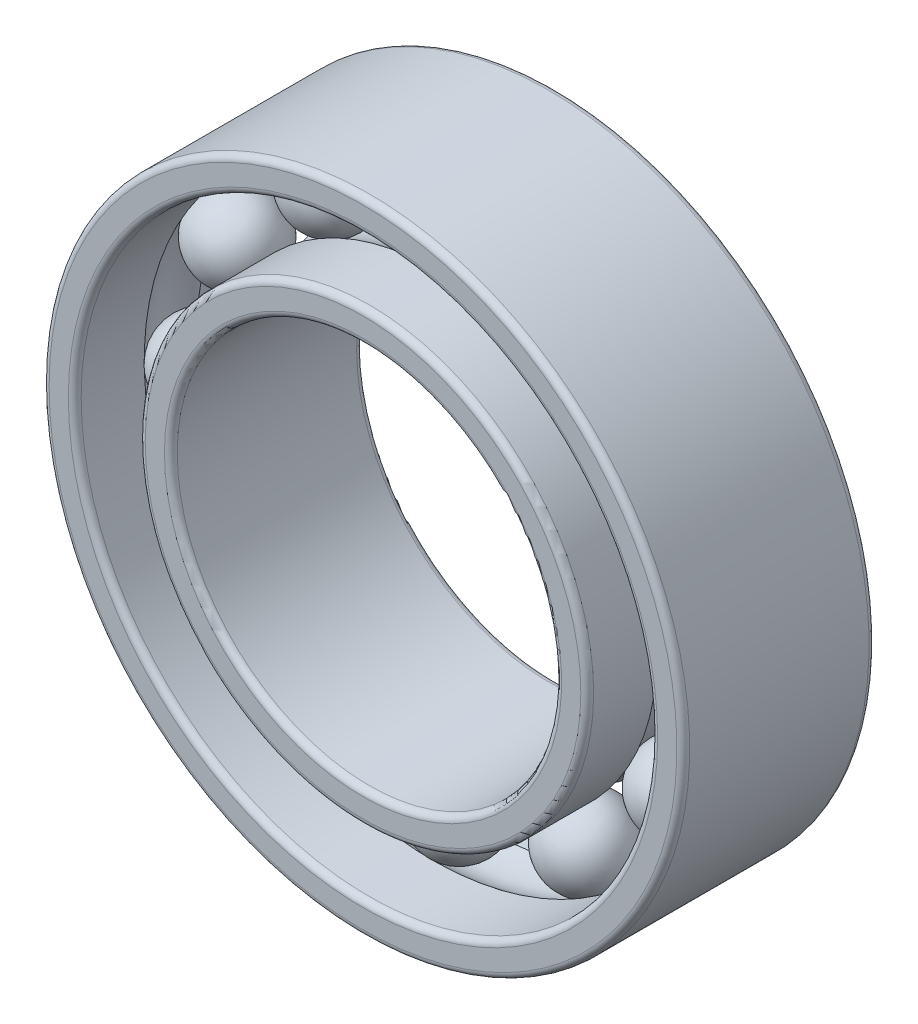
ISO-10303-21;
HEADER;
FILE_DESCRIPTION(('STEP AP214'),'2;1');
FILE_NAME('part.step','',(''),(''),'','','');
FILE_SCHEMA(('AUTOMOTIVE_DESIGN { 1 0 10303 214 1 1 1 1 }'));
ENDSEC;
DATA;
#1=APPLICATION_CONTEXT('core data for automotive mechanical design processes');
#2=APPLICATION_PROTOCOL_DEFINITION('international standard','automotive_design',2000,#1);
#3=PRODUCT_CONTEXT('',#1,'mechanical');
#4=PRODUCT('Part','Part','',(#3));
#5=PRODUCT_RELATED_PRODUCT_CATEGORY('part','',(#4));
#6=PRODUCT_DEFINITION_FORMATION('','',#4);
#7=PRODUCT_DEFINITION_CONTEXT('part definition',#1,'design');
#8=PRODUCT_DEFINITION('design','',#6,#7);
#9=PRODUCT_DEFINITION_SHAPE('','',#8);
#10=(LENGTH_UNIT() NAMED_UNIT(*) SI_UNIT(.MILLI.,.METRE.));
#11=(NAMED_UNIT(*) PLANE_ANGLE_UNIT() SI_UNIT($,.RADIAN.));
#12=(NAMED_UNIT(*) SI_UNIT($,.STERADIAN.) SOLID_ANGLE_UNIT());
#13=UNCERTAINTY_MEASURE_WITH_UNIT(LENGTH_MEASURE(1.E-05),#10,'distance_accuracy_value','');
#14=(GEOMETRIC_REPRESENTATION_CONTEXT(3) GLOBAL_UNCERTAINTY_ASSIGNED_CONTEXT((#13)) GLOBAL_UNIT_ASSIGNED_CONTEXT((#10,
#11,#12)) REPRESENTATION_CONTEXT('',''));
#15=CARTESIAN_POINT('',(0.,0.,0.));
#16=DIRECTION('',(0.,0.,1.));
#17=DIRECTION('',(1.,0.,0.));
#18=AXIS2_PLACEMENT_3D('',#15,#16,#17);
#19=CARTESIAN_POINT('',(1.99999999999996,3.46410161513778,0.));
#20=DIRECTION('',(0.,0.,1.));
#21=DIRECTION('',(0.499999999999989,0.866025403784445,0.));
#22=AXIS2_PLACEMENT_3D('',#19,#20,#21);
#23=SPHERICAL_SURFACE('',#22,0.65);
#24=CARTESIAN_POINT('',(1.99999999999996,3.46410161513778,0.65));
#25=VERTEX_POINT('',#24);
#26=VERTEX_LOOP('',#25);
#27=FACE_BOUND('',#26,.T.);
#28=ADVANCED_FACE('F38',(#27),#23,.T.);
#29=CLOSED_SHELL('',(#28));
#30=MANIFOLD_SOLID_BREP('B2',#29);
#31=CARTESIAN_POINT('',(3.46410161513773,2.00000000000004,0.));
#32=DIRECTION('',(0.,0.,1.));
#33=DIRECTION('',(0.866025403784433,0.50000000000001,0.));
#34=AXIS2_PLACEMENT_3D('',#31,#32,#33);
#35=SPHERICAL_SURFACE('',#34,0.65);
#36=CARTESIAN_POINT('',(3.46410161513773,2.00000000000004,0.65));
#37=VERTEX_POINT('',#36);
#38=VERTEX_LOOP('',#37);
#39=FACE_BOUND('',#38,.T.);
#40=ADVANCED_FACE('F57',(#39),#35,.T.);
#41=CLOSED_SHELL('',(#40));
#42=MANIFOLD_SOLID_BREP('B6',#41);
#43=CARTESIAN_POINT('',(4.,0.,0.));
#44=DIRECTION('',(0.,0.,1.));
#45=DIRECTION('',(1.,0.,0.));
#46=AXIS2_PLACEMENT_3D('',#43,#44,#45);
#47=SPHERICAL_SURFACE('',#46,0.65);
#48=CARTESIAN_POINT('',(4.,0.,0.65));
#49=VERTEX_POINT('',#48);
#50=VERTEX_LOOP('',#49);
#51=FACE_BOUND('',#50,.T.);
#52=ADVANCED_FACE('F76',(#51),#47,.T.);
#53=CLOSED_SHELL('',(#52));
#54=MANIFOLD_SOLID_BREP('B34',#53);
#55=CARTESIAN_POINT('',(3.46410161513777,-1.99999999999997,0.));
#56=DIRECTION('',(0.,0.,1.));
#57=DIRECTION('',(0.866025403784443,-0.499999999999992,0.));
#58=AXIS2_PLACEMENT_3D('',#55,#56,#57);
#59=SPHERICAL_SURFACE('',#58,0.65);
#60=CARTESIAN_POINT('',(3.46410161513777,-1.99999999999997,0.65));
#61=VERTEX_POINT('',#60);
#62=VERTEX_LOOP('',#61);
#63=FACE_BOUND('',#62,.T.);
#64=ADVANCED_FACE('F95',(#63),#59,.T.);
#65=CLOSED_SHELL('',(#64));
#66=MANIFOLD_SOLID_BREP('B53',#65);
#67=CARTESIAN_POINT('',(2.00000000000003,-3.46410161513774,0.));
#68=DIRECTION('',(0.,0.,1.));
#69=DIRECTION('',(0.500000000000007,-0.866025403784435,0.));
#70=AXIS2_PLACEMENT_3D('',#67,#68,#69);
#71=SPHERICAL_SURFACE('',#70,0.65);
#72=CARTESIAN_POINT('',(2.00000000000003,-3.46410161513774,0.65));
#73=VERTEX_POINT('',#72);
#74=VERTEX_LOOP('',#73);
#75=FACE_BOUND('',#74,.T.);
#76=ADVANCED_FACE('F114',(#75),#71,.T.);
#77=CLOSED_SHELL('',(#76));
#78=MANIFOLD_SOLID_BREP('B72',#77);
#79=CARTESIAN_POINT('',(0.,-4.,0.));
#80=DIRECTION('',(0.,0.,1.));
#81=DIRECTION('',(0.,-1.,0.));
#82=AXIS2_PLACEMENT_3D('',#79,#80,#81);
#83=SPHERICAL_SURFACE('',#82,0.65);
#84=CARTESIAN_POINT('',(0.,-4.,0.65));
#85=VERTEX_POINT('',#84);
#86=VERTEX_LOOP('',#85);
#87=FACE_BOUND('',#86,.T.);
#88=ADVANCED_FACE('F133',(#87),#83,.T.);
#89=CLOSED_SHELL('',(#88));
#90=MANIFOLD_SOLID_BREP('B91',#89);
#91=CARTESIAN_POINT('',(-1.99999999999998,-3.46410161513777,0.));
#92=DIRECTION('',(0.,0.,1.));
#93=DIRECTION('',(-0.499999999999995,-0.866025403784442,0.));
#94=AXIS2_PLACEMENT_3D('',#91,#92,#93);
#95=SPHERICAL_SURFACE('',#94,0.65);
#96=CARTESIAN_POINT('',(-1.99999999999998,-3.46410161513777,0.65));
#97=VERTEX_POINT('',#96);
#98=VERTEX_LOOP('',#97);
#99=FACE_BOUND('',#98,.T.);
#100=ADVANCED_FACE('F152',(#99),#95,.T.);
#101=CLOSED_SHELL('',(#100));
#102=MANIFOLD_SOLID_BREP('B110',#101);
#103=CARTESIAN_POINT('',(-3.46410161513775,-2.00000000000002,0.));
#104=DIRECTION('',(0.,0.,1.));
#105=DIRECTION('',(-0.866025403784436,-0.500000000000004,0.));
#106=AXIS2_PLACEMENT_3D('',#103,#104,#105);
#107=SPHERICAL_SURFACE('',#106,0.65);
#108=CARTESIAN_POINT('',(-3.46410161513775,-2.00000000000002,0.65));
#109=VERTEX_POINT('',#108);
#110=VERTEX_LOOP('',#109);
#111=FACE_BOUND('',#110,.T.);
#112=ADVANCED_FACE('F171',(#111),#107,.T.);
#113=CLOSED_SHELL('',(#112));
#114=MANIFOLD_SOLID_BREP('B129',#113);
#115=CARTESIAN_POINT('',(-4.,0.,0.));
#116=DIRECTION('',(0.,0.,1.));
#117=DIRECTION('',(-1.,0.,0.));
#118=AXIS2_PLACEMENT_3D('',#115,#116,#117);
#119=SPHERICAL_SURFACE('',#118,0.65);
#120=CARTESIAN_POINT('',(-4.,0.,0.65));
#121=VERTEX_POINT('',#120);
#122=VERTEX_LOOP('',#121);
#123=FACE_BOUND('',#122,.T.);
#124=ADVANCED_FACE('F190',(#123),#119,.T.);
#125=CLOSED_SHELL('',(#124));
#126=MANIFOLD_SOLID_BREP('B148',#125);
#127=CARTESIAN_POINT('',(-3.46410161513776,1.99999999999999,0.));
#128=DIRECTION('',(0.,0.,1.));
#129=DIRECTION('',(-0.86602540378444,0.499999999999998,0.));
#130=AXIS2_PLACEMENT_3D('',#127,#128,#129);
#131=SPHERICAL_SURFACE('',#130,0.65);
#132=CARTESIAN_POINT('',(-3.46410161513776,1.99999999999999,0.65));
#133=VERTEX_POINT('',#132);
#134=VERTEX_LOOP('',#133);
#135=FACE_BOUND('',#134,.T.);
#136=ADVANCED_FACE('F209',(#135),#131,.T.);
#137=CLOSED_SHELL('',(#136));
#138=MANIFOLD_SOLID_BREP('B167',#137);
#139=CARTESIAN_POINT('',(-2.,3.46410161513775,0.));
#140=DIRECTION('',(0.,0.,1.));
#141=DIRECTION('',(-0.500000000000001,0.866025403784438,0.));
#142=AXIS2_PLACEMENT_3D('',#139,#140,#141);
#143=SPHERICAL_SURFACE('',#142,0.65);
#144=CARTESIAN_POINT('',(-2.,3.46410161513775,0.65));
#145=VERTEX_POINT('',#144);
#146=VERTEX_LOOP('',#145);
#147=FACE_BOUND('',#146,.T.);
#148=ADVANCED_FACE('F228',(#147),#143,.T.);
#149=CLOSED_SHELL('',(#148));
#150=MANIFOLD_SOLID_BREP('B186',#149);
#151=CARTESIAN_POINT('',(0.,4.,0.));
#152=DIRECTION('',(0.,0.,1.));
#153=DIRECTION('',(0.,1.,0.));
#154=AXIS2_PLACEMENT_3D('',#151,#152,#153);
#155=SPHERICAL_SURFACE('',#154,0.65);
#156=CARTESIAN_POINT('',(0.,4.,0.65));
#157=VERTEX_POINT('',#156);
#158=VERTEX_LOOP('',#157);
#159=FACE_BOUND('',#158,.T.);
#160=ADVANCED_FACE('F249',(#159),#155,.T.);
#161=CLOSED_SHELL('',(#160));
#162=MANIFOLD_SOLID_BREP('B205',#161);
#163=CARTESIAN_POINT('',(0.,0.,0.));
#164=DIRECTION('',(0.,0.,1.));
#165=DIRECTION('',(1.,0.,0.));
#166=AXIS2_PLACEMENT_3D('',#163,#164,#165);
#167=TOROIDAL_SURFACE('',#166,4.,0.65);
#168=CARTESIAN_POINT('',(0.,0.,-0.415331193145903));
#169=DIRECTION('',(0.,0.,1.));
#170=DIRECTION('',(1.,0.,0.));
#171=AXIS2_PLACEMENT_3D('',#168,#169,#170);
#172=CIRCLE('',#171,3.5);
#173=CARTESIAN_POINT('',(3.5,0.,-0.415331193145903));
#174=VERTEX_POINT('',#173);
#175=EDGE_CURVE('E304',#174,#174,#172,.T.);
#176=ORIENTED_EDGE('',*,*,#175,.T.);
#177=EDGE_LOOP('',(#176));
#178=FACE_BOUND('',#177,.T.);
#179=CARTESIAN_POINT('',(0.,0.,0.415331193145903));
#180=DIRECTION('',(0.,0.,1.));
#181=DIRECTION('',(1.,0.,0.));
#182=AXIS2_PLACEMENT_3D('',#179,#180,#181);
#183=CIRCLE('',#182,3.5);
#184=CARTESIAN_POINT('',(3.5,0.,0.415331193145903));
#185=VERTEX_POINT('',#184);
#186=EDGE_CURVE('E301',#185,#185,#183,.T.);
#187=ORIENTED_EDGE('',*,*,#186,.F.);
#188=EDGE_LOOP('',(#187));
#189=FACE_BOUND('',#188,.T.);
#190=ADVANCED_FACE('F269',(#178,#189),#167,.F.);
#191=CARTESIAN_POINT('',(0.,0.,0.));
#192=DIRECTION('',(0.,0.,1.));
#193=DIRECTION('',(1.,0.,0.));
#194=AXIS2_PLACEMENT_3D('',#191,#192,#193);
#195=CYLINDRICAL_SURFACE('',#194,3.5);
#196=CARTESIAN_POINT('',(0.,0.,1.4));
#197=DIRECTION('',(0.,0.,-1.));
#198=DIRECTION('',(-1.,0.,0.));
#199=AXIS2_PLACEMENT_3D('',#196,#197,#198);
#200=CIRCLE('',#199,3.5);
#201=CARTESIAN_POINT('',(-3.5,0.,1.4));
#202=VERTEX_POINT('',#201);
#203=EDGE_CURVE('E248',#202,#202,#200,.T.);
#204=ORIENTED_EDGE('',*,*,#203,.T.);
#205=EDGE_LOOP('',(#204));
#206=FACE_BOUND('',#205,.T.);
#207=ORIENTED_EDGE('',*,*,#186,.T.);
#208=EDGE_LOOP('',(#207));
#209=FACE_BOUND('',#208,.T.);
#210=ADVANCED_FACE('F327',(#206,#209),#195,.T.);
#211=CARTESIAN_POINT('',(0.,0.,1.5));
#212=DIRECTION('',(0.,0.,-1.));
#213=DIRECTION('',(-1.,0.,0.));
#214=AXIS2_PLACEMENT_3D('',#211,#212,#213);
#215=PLANE('',#214);
#216=CARTESIAN_POINT('',(0.,0.,1.5));
#217=DIRECTION('',(0.,0.,-1.));
#218=DIRECTION('',(-1.,0.,0.));
#219=AXIS2_PLACEMENT_3D('',#216,#217,#218);
#220=CIRCLE('',#219,3.4);
#221=CARTESIAN_POINT('',(-3.4,0.,1.5));
#222=VERTEX_POINT('',#221);
#223=EDGE_CURVE('E276',#222,#222,#220,.F.);
#224=ORIENTED_EDGE('',*,*,#223,.T.);
#225=EDGE_LOOP('',(#224));
#226=FACE_BOUND('',#225,.T.);
#227=CARTESIAN_POINT('',(0.,0.,1.5));
#228=DIRECTION('',(0.,0.,-1.));
#229=DIRECTION('',(-1.,0.,0.));
#230=AXIS2_PLACEMENT_3D('',#227,#228,#229);
#231=CIRCLE('',#230,3.1);
#232=CARTESIAN_POINT('',(-3.1,0.,1.5));
#233=VERTEX_POINT('',#232);
#234=EDGE_CURVE('E280',#233,#233,#231,.T.);
#235=ORIENTED_EDGE('',*,*,#234,.T.);
#236=EDGE_LOOP('',(#235));
#237=FACE_BOUND('',#236,.T.);
#238=ADVANCED_FACE('F332',(#226,#237),#215,.F.);
#239=CARTESIAN_POINT('',(0.,0.,0.));
#240=DIRECTION('',(0.,0.,1.));
#241=DIRECTION('',(1.,0.,0.));
#242=AXIS2_PLACEMENT_3D('',#239,#240,#241);
#243=CYLINDRICAL_SURFACE('',#242,3.);
#244=CARTESIAN_POINT('',(0.,0.,-1.4));
#245=DIRECTION('',(0.,0.,-1.));
#246=DIRECTION('',(-1.,0.,0.));
#247=AXIS2_PLACEMENT_3D('',#244,#245,#246);
#248=CIRCLE('',#247,3.);
#249=CARTESIAN_POINT('',(-3.,0.,-1.4));
#250=VERTEX_POINT('',#249);
#251=EDGE_CURVE('E284',#250,#250,#248,.T.);
#252=ORIENTED_EDGE('',*,*,#251,.T.);
#253=EDGE_LOOP('',(#252));
#254=FACE_BOUND('',#253,.T.);
#255=CARTESIAN_POINT('',(0.,0.,1.4));
#256=DIRECTION('',(0.,0.,-1.));
#257=DIRECTION('',(-1.,0.,0.));
#258=AXIS2_PLACEMENT_3D('',#255,#256,#257);
#259=CIRCLE('',#258,3.);
#260=CARTESIAN_POINT('',(-3.,0.,1.4));
#261=VERTEX_POINT('',#260);
#262=EDGE_CURVE('E289',#261,#261,#259,.F.);
#263=ORIENTED_EDGE('',*,*,#262,.T.);
#264=EDGE_LOOP('',(#263));
#265=FACE_BOUND('',#264,.T.);
#266=ADVANCED_FACE('F323',(#254,#265),#243,.F.);
#267=CARTESIAN_POINT('',(0.,0.,-1.5));
#268=DIRECTION('',(0.,0.,-1.));
#269=DIRECTION('',(-1.,0.,0.));
#270=AXIS2_PLACEMENT_3D('',#267,#268,#269);
#271=PLANE('',#270);
#272=CARTESIAN_POINT('',(0.,0.,-1.5));
#273=DIRECTION('',(0.,0.,-1.));
#274=DIRECTION('',(-1.,0.,0.));
#275=AXIS2_PLACEMENT_3D('',#272,#273,#274);
#276=CIRCLE('',#275,3.4);
#277=CARTESIAN_POINT('',(-3.4,0.,-1.5));
#278=VERTEX_POINT('',#277);
#279=EDGE_CURVE('E292',#278,#278,#276,.T.);
#280=ORIENTED_EDGE('',*,*,#279,.T.);
#281=EDGE_LOOP('',(#280));
#282=FACE_BOUND('',#281,.T.);
#283=CARTESIAN_POINT('',(0.,0.,-1.5));
#284=DIRECTION('',(0.,0.,-1.));
#285=DIRECTION('',(-1.,0.,0.));
#286=AXIS2_PLACEMENT_3D('',#283,#284,#285);
#287=CIRCLE('',#286,3.1);
#288=CARTESIAN_POINT('',(-3.1,0.,-1.5));
#289=VERTEX_POINT('',#288);
#290=EDGE_CURVE('E295',#289,#289,#287,.F.);
#291=ORIENTED_EDGE('',*,*,#290,.T.);
#292=EDGE_LOOP('',(#291));
#293=FACE_BOUND('',#292,.T.);
#294=ADVANCED_FACE('F313',(#282,#293),#271,.T.);
#295=CARTESIAN_POINT('',(0.,0.,0.));
#296=DIRECTION('',(0.,0.,1.));
#297=DIRECTION('',(1.,0.,0.));
#298=AXIS2_PLACEMENT_3D('',#295,#296,#297);
#299=CYLINDRICAL_SURFACE('',#298,3.5);
#300=CARTESIAN_POINT('',(0.,0.,-1.4));
#301=DIRECTION('',(0.,0.,-1.));
#302=DIRECTION('',(-1.,0.,0.));
#303=AXIS2_PLACEMENT_3D('',#300,#301,#302);
#304=CIRCLE('',#303,3.5);
#305=CARTESIAN_POINT('',(-3.5,0.,-1.4));
#306=VERTEX_POINT('',#305);
#307=EDGE_CURVE('E298',#306,#306,#304,.F.);
#308=ORIENTED_EDGE('',*,*,#307,.T.);
#309=EDGE_LOOP('',(#308));
#310=FACE_BOUND('',#309,.T.);
#311=ORIENTED_EDGE('',*,*,#175,.F.);
#312=EDGE_LOOP('',(#311));
#313=FACE_BOUND('',#312,.T.);
#314=ADVANCED_FACE('F310',(#310,#313),#299,.T.);
#315=CARTESIAN_POINT('',(0.,0.,-1.4));
#316=DIRECTION('',(0.,0.,-1.));
#317=DIRECTION('',(-1.,0.,0.));
#318=AXIS2_PLACEMENT_3D('',#315,#316,#317);
#319=TOROIDAL_SURFACE('',#318,3.4,0.1);
#320=ORIENTED_EDGE('',*,*,#279,.F.);
#321=EDGE_LOOP('',(#320));
#322=FACE_BOUND('',#321,.T.);
#323=ORIENTED_EDGE('',*,*,#307,.F.);
#324=EDGE_LOOP('',(#323));
#325=FACE_BOUND('',#324,.T.);
#326=ADVANCED_FACE('F312',(#322,#325),#319,.T.);
#327=CARTESIAN_POINT('',(0.,0.,-1.4));
#328=DIRECTION('',(0.,0.,-1.));
#329=DIRECTION('',(-1.,0.,0.));
#330=AXIS2_PLACEMENT_3D('',#327,#328,#329);
#331=TOROIDAL_SURFACE('',#330,3.1,0.1);
#332=ORIENTED_EDGE('',*,*,#251,.F.);
#333=EDGE_LOOP('',(#332));
#334=FACE_BOUND('',#333,.T.);
#335=ORIENTED_EDGE('',*,*,#290,.F.);
#336=EDGE_LOOP('',(#335));
#337=FACE_BOUND('',#336,.T.);
#338=ADVANCED_FACE('F320',(#334,#337),#331,.T.);
#339=CARTESIAN_POINT('',(0.,0.,1.4));
#340=DIRECTION('',(0.,0.,-1.));
#341=DIRECTION('',(-1.,0.,0.));
#342=AXIS2_PLACEMENT_3D('',#339,#340,#341);
#343=TOROIDAL_SURFACE('',#342,3.4,0.1);
#344=ORIENTED_EDGE('',*,*,#203,.F.);
#345=EDGE_LOOP('',(#344));
#346=FACE_BOUND('',#345,.T.);
#347=ORIENTED_EDGE('',*,*,#223,.F.);
#348=EDGE_LOOP('',(#347));
#349=FACE_BOUND('',#348,.T.);
#350=ADVANCED_FACE('F337',(#346,#349),#343,.T.);
#351=CARTESIAN_POINT('',(0.,0.,1.4));
#352=DIRECTION('',(0.,0.,-1.));
#353=DIRECTION('',(-1.,0.,0.));
#354=AXIS2_PLACEMENT_3D('',#351,#352,#353);
#355=TOROIDAL_SURFACE('',#354,3.1,0.1);
#356=ORIENTED_EDGE('',*,*,#234,.F.);
#357=EDGE_LOOP('',(#356));
#358=FACE_BOUND('',#357,.T.);
#359=ORIENTED_EDGE('',*,*,#262,.F.);
#360=EDGE_LOOP('',(#359));
#361=FACE_BOUND('',#360,.T.);
#362=ADVANCED_FACE('F271',(#358,#361),#355,.T.);
#363=CLOSED_SHELL('',(#190,#210,#238,#266,#294,#314,#326,#338,#350,#362));
#364=MANIFOLD_SOLID_BREP('B224',#363);
#365=CARTESIAN_POINT('',(0.,0.,0.));
#366=DIRECTION('',(0.,0.,1.));
#367=DIRECTION('',(1.,0.,0.));
#368=AXIS2_PLACEMENT_3D('',#365,#366,#367);
#369=TOROIDAL_SURFACE('',#368,4.,0.65);
#370=CARTESIAN_POINT('',(0.,0.,0.415331193145904));
#371=DIRECTION('',(0.,0.,1.));
#372=DIRECTION('',(1.,0.,0.));
#373=AXIS2_PLACEMENT_3D('',#370,#371,#372);
#374=CIRCLE('',#373,4.5);
#375=CARTESIAN_POINT('',(4.5,0.,0.415331193145904));
#376=VERTEX_POINT('',#375);
#377=EDGE_CURVE('E456',#376,#376,#374,.T.);
#378=ORIENTED_EDGE('',*,*,#377,.T.);
#379=EDGE_LOOP('',(#378));
#380=FACE_BOUND('',#379,.T.);
#381=CARTESIAN_POINT('',(0.,0.,-0.415331193145904));
#382=DIRECTION('',(0.,0.,1.));
#383=DIRECTION('',(1.,0.,0.));
#384=AXIS2_PLACEMENT_3D('',#381,#382,#383);
#385=CIRCLE('',#384,4.5);
#386=CARTESIAN_POINT('',(4.5,0.,-0.415331193145904));
#387=VERTEX_POINT('',#386);
#388=EDGE_CURVE('E453',#387,#387,#385,.T.);
#389=ORIENTED_EDGE('',*,*,#388,.F.);
#390=EDGE_LOOP('',(#389));
#391=FACE_BOUND('',#390,.T.);
#392=ADVANCED_FACE('F421',(#380,#391),#369,.F.);
#393=CARTESIAN_POINT('',(0.,0.,0.));
#394=DIRECTION('',(0.,0.,1.));
#395=DIRECTION('',(1.,0.,0.));
#396=AXIS2_PLACEMENT_3D('',#393,#394,#395);
#397=CYLINDRICAL_SURFACE('',#396,4.5);
#398=CARTESIAN_POINT('',(0.,0.,-1.4));
#399=DIRECTION('',(0.,0.,-1.));
#400=DIRECTION('',(-1.,0.,0.));
#401=AXIS2_PLACEMENT_3D('',#398,#399,#400);
#402=CIRCLE('',#401,4.5);
#403=CARTESIAN_POINT('',(-4.5,0.,-1.4));
#404=VERTEX_POINT('',#403);
#405=EDGE_CURVE('E444',#404,#404,#402,.T.);
#406=ORIENTED_EDGE('',*,*,#405,.T.);
#407=EDGE_LOOP('',(#406));
#408=FACE_BOUND('',#407,.T.);
#409=ORIENTED_EDGE('',*,*,#388,.T.);
#410=EDGE_LOOP('',(#409));
#411=FACE_BOUND('',#410,.T.);
#412=ADVANCED_FACE('F479',(#408,#411),#397,.F.);
#413=CARTESIAN_POINT('',(0.,0.,-1.5));
#414=DIRECTION('',(0.,0.,-1.));
#415=DIRECTION('',(-1.,0.,0.));
#416=AXIS2_PLACEMENT_3D('',#413,#414,#415);
#417=PLANE('',#416);
#418=CARTESIAN_POINT('',(0.,0.,-1.5));
#419=DIRECTION('',(0.,0.,-1.));
#420=DIRECTION('',(-1.,0.,0.));
#421=AXIS2_PLACEMENT_3D('',#418,#419,#420);
#422=CIRCLE('',#421,4.6);
#423=CARTESIAN_POINT('',(-4.6,0.,-1.5));
#424=VERTEX_POINT('',#423);
#425=EDGE_CURVE('E447',#424,#424,#422,.F.);
#426=ORIENTED_EDGE('',*,*,#425,.T.);
#427=EDGE_LOOP('',(#426));
#428=FACE_BOUND('',#427,.T.);
#429=CARTESIAN_POINT('',(0.,0.,-1.5));
#430=DIRECTION('',(0.,0.,-1.));
#431=DIRECTION('',(-1.,0.,0.));
#432=AXIS2_PLACEMENT_3D('',#429,#430,#431);
#433=CIRCLE('',#432,4.9);
#434=CARTESIAN_POINT('',(-4.9,0.,-1.5));
#435=VERTEX_POINT('',#434);
#436=EDGE_CURVE('E450',#435,#435,#433,.T.);
#437=ORIENTED_EDGE('',*,*,#436,.T.);
#438=EDGE_LOOP('',(#437));
#439=FACE_BOUND('',#438,.T.);
#440=ADVANCED_FACE('F484',(#428,#439),#417,.T.);
#441=CARTESIAN_POINT('',(0.,0.,0.));
#442=DIRECTION('',(0.,0.,1.));
#443=DIRECTION('',(1.,0.,0.));
#444=AXIS2_PLACEMENT_3D('',#441,#442,#443);
#445=CYLINDRICAL_SURFACE('',#444,5.);
#446=CARTESIAN_POINT('',(0.,0.,-1.4));
#447=DIRECTION('',(0.,0.,-1.));
#448=DIRECTION('',(-1.,0.,0.));
#449=AXIS2_PLACEMENT_3D('',#446,#447,#448);
#450=CIRCLE('',#449,5.);
#451=CARTESIAN_POINT('',(-5.,0.,-1.4));
#452=VERTEX_POINT('',#451);
#453=EDGE_CURVE('E268',#452,#452,#450,.F.);
#454=ORIENTED_EDGE('',*,*,#453,.T.);
#455=EDGE_LOOP('',(#454));
#456=FACE_BOUND('',#455,.T.);
#457=CARTESIAN_POINT('',(0.,0.,1.4));
#458=DIRECTION('',(0.,0.,-1.));
#459=DIRECTION('',(-1.,0.,0.));
#460=AXIS2_PLACEMENT_3D('',#457,#458,#459);
#461=CIRCLE('',#460,5.);
#462=CARTESIAN_POINT('',(-5.,0.,1.4));
#463=VERTEX_POINT('',#462);
#464=EDGE_CURVE('E428',#463,#463,#461,.T.);
#465=ORIENTED_EDGE('',*,*,#464,.T.);
#466=EDGE_LOOP('',(#465));
#467=FACE_BOUND('',#466,.T.);
#468=ADVANCED_FACE('F475',(#456,#467),#445,.T.);
#469=CARTESIAN_POINT('',(0.,0.,1.5));
#470=DIRECTION('',(0.,0.,-1.));
#471=DIRECTION('',(-1.,0.,0.));
#472=AXIS2_PLACEMENT_3D('',#469,#470,#471);
#473=PLANE('',#472);
#474=CARTESIAN_POINT('',(0.,0.,1.5));
#475=DIRECTION('',(0.,0.,-1.));
#476=DIRECTION('',(-1.,0.,0.));
#477=AXIS2_PLACEMENT_3D('',#474,#475,#476);
#478=CIRCLE('',#477,4.6);
#479=CARTESIAN_POINT('',(-4.6,0.,1.5));
#480=VERTEX_POINT('',#479);
#481=EDGE_CURVE('E432',#480,#480,#478,.T.);
#482=ORIENTED_EDGE('',*,*,#481,.T.);
#483=EDGE_LOOP('',(#482));
#484=FACE_BOUND('',#483,.T.);
#485=CARTESIAN_POINT('',(0.,0.,1.5));
#486=DIRECTION('',(0.,0.,-1.));
#487=DIRECTION('',(-1.,0.,0.));
#488=AXIS2_PLACEMENT_3D('',#485,#486,#487);
#489=CIRCLE('',#488,4.9);
#490=CARTESIAN_POINT('',(-4.9,0.,1.5));
#491=VERTEX_POINT('',#490);
#492=EDGE_CURVE('E436',#491,#491,#489,.F.);
#493=ORIENTED_EDGE('',*,*,#492,.T.);
#494=EDGE_LOOP('',(#493));
#495=FACE_BOUND('',#494,.T.);
#496=ADVANCED_FACE('F465',(#484,#495),#473,.F.);
#497=CARTESIAN_POINT('',(0.,0.,0.));
#498=DIRECTION('',(0.,0.,1.));
#499=DIRECTION('',(1.,0.,0.));
#500=AXIS2_PLACEMENT_3D('',#497,#498,#499);
#501=CYLINDRICAL_SURFACE('',#500,4.5);
#502=CARTESIAN_POINT('',(0.,0.,1.4));
#503=DIRECTION('',(0.,0.,-1.));
#504=DIRECTION('',(-1.,0.,0.));
#505=AXIS2_PLACEMENT_3D('',#502,#503,#504);
#506=CIRCLE('',#505,4.5);
#507=CARTESIAN_POINT('',(-4.5,0.,1.4));
#508=VERTEX_POINT('',#507);
#509=EDGE_CURVE('E441',#508,#508,#506,.F.);
#510=ORIENTED_EDGE('',*,*,#509,.T.);
#511=EDGE_LOOP('',(#510));
#512=FACE_BOUND('',#511,.T.);
#513=ORIENTED_EDGE('',*,*,#377,.F.);
#514=EDGE_LOOP('',(#513));
#515=FACE_BOUND('',#514,.T.);
#516=ADVANCED_FACE('F462',(#512,#515),#501,.F.);
#517=CARTESIAN_POINT('',(0.,0.,-1.4));
#518=DIRECTION('',(0.,0.,-1.));
#519=DIRECTION('',(-1.,0.,0.));
#520=AXIS2_PLACEMENT_3D('',#517,#518,#519);
#521=TOROIDAL_SURFACE('',#520,4.6,0.1);
#522=ORIENTED_EDGE('',*,*,#405,.F.);
#523=EDGE_LOOP('',(#522));
#524=FACE_BOUND('',#523,.T.);
#525=ORIENTED_EDGE('',*,*,#425,.F.);
#526=EDGE_LOOP('',(#525));
#527=FACE_BOUND('',#526,.T.);
#528=ADVANCED_FACE('F464',(#524,#527),#521,.T.);
#529=CARTESIAN_POINT('',(0.,0.,1.4));
#530=DIRECTION('',(0.,0.,-1.));
#531=DIRECTION('',(-1.,0.,0.));
#532=AXIS2_PLACEMENT_3D('',#529,#530,#531);
#533=TOROIDAL_SURFACE('',#532,4.6,0.1);
#534=ORIENTED_EDGE('',*,*,#481,.F.);
#535=EDGE_LOOP('',(#534));
#536=FACE_BOUND('',#535,.T.);
#537=ORIENTED_EDGE('',*,*,#509,.F.);
#538=EDGE_LOOP('',(#537));
#539=FACE_BOUND('',#538,.T.);
#540=ADVANCED_FACE('F472',(#536,#539),#533,.T.);
#541=CARTESIAN_POINT('',(0.,0.,-1.4));
#542=DIRECTION('',(0.,0.,-1.));
#543=DIRECTION('',(-1.,0.,0.));
#544=AXIS2_PLACEMENT_3D('',#541,#542,#543);
#545=TOROIDAL_SURFACE('',#544,4.9,0.1);
#546=ORIENTED_EDGE('',*,*,#436,.F.);
#547=EDGE_LOOP('',(#546));
#548=FACE_BOUND('',#547,.T.);
#549=ORIENTED_EDGE('',*,*,#453,.F.);
#550=EDGE_LOOP('',(#549));
#551=FACE_BOUND('',#550,.T.);
#552=ADVANCED_FACE('F490',(#548,#551),#545,.T.);
#553=CARTESIAN_POINT('',(0.,0.,1.4));
#554=DIRECTION('',(0.,0.,-1.));
#555=DIRECTION('',(-1.,0.,0.));
#556=AXIS2_PLACEMENT_3D('',#553,#554,#555);
#557=TOROIDAL_SURFACE('',#556,4.9,0.1);
#558=ORIENTED_EDGE('',*,*,#464,.F.);
#559=EDGE_LOOP('',(#558));
#560=FACE_BOUND('',#559,.T.);
#561=ORIENTED_EDGE('',*,*,#492,.F.);
#562=EDGE_LOOP('',(#561));
#563=FACE_BOUND('',#562,.T.);
#564=ADVANCED_FACE('F423',(#560,#563),#557,.T.);
#565=CLOSED_SHELL('',(#392,#412,#440,#468,#496,#516,#528,#540,#552,#564));
#566=MANIFOLD_SOLID_BREP('B243',#565);
#567=ADVANCED_BREP_SHAPE_REPRESENTATION('',(#18,#30,#42,#54,#66,#78,#90,#102,#114,#126,#138,
#150,#162,#364,#566),#14);
#568=SHAPE_DEFINITION_REPRESENTATION(#9,#567);
ENDSEC;
END-ISO-10303-21;
